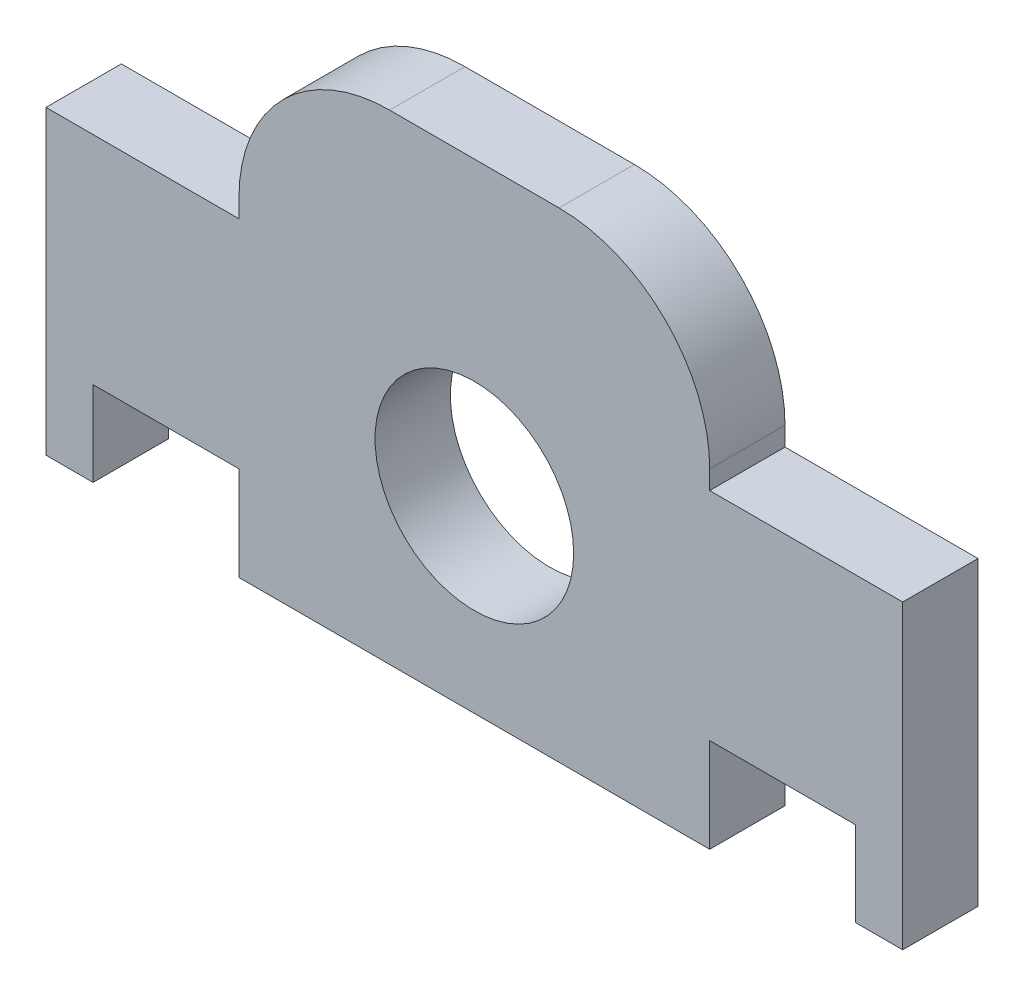
ISO-10303-21;
HEADER;
FILE_DESCRIPTION(('STEP AP214'),'2;1');
FILE_NAME('part.step','',(''),(''),'','','');
FILE_SCHEMA(('AUTOMOTIVE_DESIGN { 1 0 10303 214 1 1 1 1 }'));
ENDSEC;
DATA;
#1=APPLICATION_CONTEXT('core data for automotive mechanical design processes');
#2=APPLICATION_PROTOCOL_DEFINITION('international standard','automotive_design',2000,#1);
#3=PRODUCT_CONTEXT('',#1,'mechanical');
#4=PRODUCT('Part','Part','',(#3));
#5=PRODUCT_RELATED_PRODUCT_CATEGORY('part','',(#4));
#6=PRODUCT_DEFINITION_FORMATION('','',#4);
#7=PRODUCT_DEFINITION_CONTEXT('part definition',#1,'design');
#8=PRODUCT_DEFINITION('design','',#6,#7);
#9=PRODUCT_DEFINITION_SHAPE('','',#8);
#10=(LENGTH_UNIT() NAMED_UNIT(*) SI_UNIT(.MILLI.,.METRE.));
#11=(NAMED_UNIT(*) PLANE_ANGLE_UNIT() SI_UNIT($,.RADIAN.));
#12=(NAMED_UNIT(*) SI_UNIT($,.STERADIAN.) SOLID_ANGLE_UNIT());
#13=UNCERTAINTY_MEASURE_WITH_UNIT(LENGTH_MEASURE(1.E-05),#10,'distance_accuracy_value','');
#14=(GEOMETRIC_REPRESENTATION_CONTEXT(3) GLOBAL_UNCERTAINTY_ASSIGNED_CONTEXT((#13)) GLOBAL_UNIT_ASSIGNED_CONTEXT((#10,
#11,#12)) REPRESENTATION_CONTEXT('',''));
#15=CARTESIAN_POINT('',(0.,0.,0.));
#16=DIRECTION('',(0.,0.,1.));
#17=DIRECTION('',(1.,0.,0.));
#18=AXIS2_PLACEMENT_3D('',#15,#16,#17);
#19=CARTESIAN_POINT('',(0.,-37.205169628433,8.));
#20=DIRECTION('',(0.,1.,0.));
#21=DIRECTION('',(0.,0.,1.));
#22=AXIS2_PLACEMENT_3D('',#19,#20,#21);
#23=PLANE('',#22);
#24=DIRECTION('',(1.,0.,0.));
#25=VECTOR('',#24,1.);
#26=CARTESIAN_POINT('',(0.,-37.205169628433,8.));
#27=LINE('',#26,#25);
#28=CARTESIAN_POINT('',(-23.9256865912763,-37.205169628433,8.));
#29=VERTEX_POINT('',#28);
#30=CARTESIAN_POINT('',(26.0743134087237,-37.205169628433,8.));
#31=VERTEX_POINT('',#30);
#32=EDGE_CURVE('E315',#29,#31,#27,.T.);
#33=ORIENTED_EDGE('',*,*,#32,.F.);
#34=DIRECTION('',(0.,0.,1.));
#35=VECTOR('',#34,1.);
#36=CARTESIAN_POINT('',(-23.9256865912763,-37.205169628433,0.));
#37=LINE('',#36,#35);
#38=CARTESIAN_POINT('',(-23.9256865912763,-37.205169628433,0.));
#39=VERTEX_POINT('',#38);
#40=EDGE_CURVE('E279',#39,#29,#37,.T.);
#41=ORIENTED_EDGE('',*,*,#40,.F.);
#42=DIRECTION('',(1.,0.,0.));
#43=VECTOR('',#42,1.);
#44=CARTESIAN_POINT('',(0.,-37.205169628433,0.));
#45=LINE('',#44,#43);
#46=CARTESIAN_POINT('',(26.0743134087237,-37.205169628433,0.));
#47=VERTEX_POINT('',#46);
#48=EDGE_CURVE('E310',#39,#47,#45,.T.);
#49=ORIENTED_EDGE('',*,*,#48,.T.);
#50=DIRECTION('',(0.,0.,1.));
#51=VECTOR('',#50,1.);
#52=CARTESIAN_POINT('',(26.0743134087237,-37.205169628433,0.));
#53=LINE('',#52,#51);
#54=EDGE_CURVE('E242',#47,#31,#53,.T.);
#55=ORIENTED_EDGE('',*,*,#54,.T.);
#56=EDGE_LOOP('',(#33,#41,#49,#55));
#57=FACE_BOUND('',#56,.T.);
#58=ADVANCED_FACE('F44',(#57),#23,.F.);
#59=CARTESIAN_POINT('',(0.,13.794830371567,8.));
#60=DIRECTION('',(0.,1.,0.));
#61=DIRECTION('',(0.,0.,1.));
#62=AXIS2_PLACEMENT_3D('',#59,#60,#61);
#63=PLANE('',#62);
#64=DIRECTION('',(1.,0.,0.));
#65=VECTOR('',#64,1.);
#66=CARTESIAN_POINT('',(0.,13.794830371567,8.));
#67=LINE('',#66,#65);
#68=CARTESIAN_POINT('',(-7.92568659127614,13.794830371567,8.));
#69=VERTEX_POINT('',#68);
#70=CARTESIAN_POINT('',(10.0743134087236,13.794830371567,8.));
#71=VERTEX_POINT('',#70);
#72=EDGE_CURVE('E52',#69,#71,#67,.T.);
#73=ORIENTED_EDGE('',*,*,#72,.T.);
#74=DIRECTION('',(0.,0.,1.));
#75=VECTOR('',#74,1.);
#76=CARTESIAN_POINT('',(10.0743134087236,13.794830371567,0.));
#77=LINE('',#76,#75);
#78=CARTESIAN_POINT('',(10.0743134087236,13.794830371567,0.));
#79=VERTEX_POINT('',#78);
#80=EDGE_CURVE('E256',#79,#71,#77,.T.);
#81=ORIENTED_EDGE('',*,*,#80,.F.);
#82=DIRECTION('',(1.,0.,0.));
#83=VECTOR('',#82,1.);
#84=CARTESIAN_POINT('',(0.,13.794830371567,0.));
#85=LINE('',#84,#83);
#86=CARTESIAN_POINT('',(-7.92568659127614,13.794830371567,0.));
#87=VERTEX_POINT('',#86);
#88=EDGE_CURVE('E321',#87,#79,#85,.T.);
#89=ORIENTED_EDGE('',*,*,#88,.F.);
#90=DIRECTION('',(0.,0.,1.));
#91=VECTOR('',#90,1.);
#92=CARTESIAN_POINT('',(-7.92568659127614,13.794830371567,0.));
#93=LINE('',#92,#91);
#94=EDGE_CURVE('E299',#87,#69,#93,.T.);
#95=ORIENTED_EDGE('',*,*,#94,.T.);
#96=EDGE_LOOP('',(#73,#81,#89,#95));
#97=FACE_BOUND('',#96,.T.);
#98=ADVANCED_FACE('F345',(#97),#63,.T.);
#99=CARTESIAN_POINT('',(0.,0.,8.));
#100=DIRECTION('',(0.,0.,1.));
#101=DIRECTION('',(1.,0.,0.));
#102=AXIS2_PLACEMENT_3D('',#99,#100,#101);
#103=PLANE('',#102);
#104=CARTESIAN_POINT('',(1.07431340872375,-17.205169628433,8.));
#105=DIRECTION('',(0.,0.,1.));
#106=DIRECTION('',(1.,0.,0.));
#107=AXIS2_PLACEMENT_3D('',#104,#105,#106);
#108=CIRCLE('',#107,10.55);
#109=CARTESIAN_POINT('',(11.6243134087237,-17.205169628433,8.));
#110=VERTEX_POINT('',#109);
#111=EDGE_CURVE('E11',#110,#110,#108,.T.);
#112=ORIENTED_EDGE('',*,*,#111,.F.);
#113=EDGE_LOOP('',(#112));
#114=FACE_BOUND('',#113,.T.);
#115=DIRECTION('',(1.,0.,0.));
#116=VECTOR('',#115,1.);
#117=CARTESIAN_POINT('',(26.0743134087237,-27.205169628433,8.));
#118=LINE('',#117,#116);
#119=CARTESIAN_POINT('',(26.0743134087237,-27.205169628433,8.));
#120=VERTEX_POINT('',#119);
#121=CARTESIAN_POINT('',(41.5743134087237,-27.205169628433,8.));
#122=VERTEX_POINT('',#121);
#123=EDGE_CURVE('E246',#120,#122,#118,.T.);
#124=ORIENTED_EDGE('',*,*,#123,.T.);
#125=DIRECTION('',(0.,1.,0.));
#126=VECTOR('',#125,1.);
#127=CARTESIAN_POINT('',(41.5743134087237,-36.205169628433,8.));
#128=LINE('',#127,#126);
#129=CARTESIAN_POINT('',(41.5743134087237,-36.205169628433,8.));
#130=VERTEX_POINT('',#129);
#131=EDGE_CURVE('E197',#130,#122,#128,.T.);
#132=ORIENTED_EDGE('',*,*,#131,.F.);
#133=DIRECTION('',(1.,0.,0.));
#134=VECTOR('',#133,1.);
#135=CARTESIAN_POINT('',(0.,-36.205169628433,8.));
#136=LINE('',#135,#134);
#137=CARTESIAN_POINT('',(46.5743134087237,-36.205169628433,8.));
#138=VERTEX_POINT('',#137);
#139=EDGE_CURVE('E189',#130,#138,#136,.T.);
#140=ORIENTED_EDGE('',*,*,#139,.T.);
#141=DIRECTION('',(0.,1.,0.));
#142=VECTOR('',#141,1.);
#143=CARTESIAN_POINT('',(46.5743134087237,-36.205169628433,8.));
#144=LINE('',#143,#142);
#145=CARTESIAN_POINT('',(46.5743134087237,-4.20516962843296,8.));
#146=VERTEX_POINT('',#145);
#147=EDGE_CURVE('E172',#138,#146,#144,.T.);
#148=ORIENTED_EDGE('',*,*,#147,.T.);
#149=DIRECTION('',(-1.,0.,0.));
#150=VECTOR('',#149,1.);
#151=CARTESIAN_POINT('',(0.,-4.20516962843296,8.));
#152=LINE('',#151,#150);
#153=CARTESIAN_POINT('',(26.0743134087237,-4.20516962843296,8.));
#154=VERTEX_POINT('',#153);
#155=EDGE_CURVE('E264',#146,#154,#152,.T.);
#156=ORIENTED_EDGE('',*,*,#155,.T.);
#157=DIRECTION('',(0.,-1.,0.));
#158=VECTOR('',#157,1.);
#159=CARTESIAN_POINT('',(26.0743134087237,0.,8.));
#160=LINE('',#159,#158);
#161=CARTESIAN_POINT('',(26.0743134087237,-2.20516962843307,8.));
#162=VERTEX_POINT('',#161);
#163=EDGE_CURVE('E266',#162,#154,#160,.T.);
#164=ORIENTED_EDGE('',*,*,#163,.F.);
#165=CARTESIAN_POINT('',(10.0743134087237,-2.20516962843296,8.));
#166=DIRECTION('',(0.,0.,1.));
#167=DIRECTION('',(1.,0.,0.));
#168=AXIS2_PLACEMENT_3D('',#165,#166,#167);
#169=CIRCLE('',#168,16.);
#170=EDGE_CURVE('E270',#71,#162,#169,.F.);
#171=ORIENTED_EDGE('',*,*,#170,.F.);
#172=ORIENTED_EDGE('',*,*,#72,.F.);
#173=CARTESIAN_POINT('',(-7.92568659127625,-2.20516962843295,8.));
#174=DIRECTION('',(0.,0.,1.));
#175=DIRECTION('',(1.,0.,0.));
#176=AXIS2_PLACEMENT_3D('',#173,#174,#175);
#177=CIRCLE('',#176,16.);
#178=CARTESIAN_POINT('',(-23.9256865912762,-2.20516962843307,8.));
#179=VERTEX_POINT('',#178);
#180=EDGE_CURVE('E273',#69,#179,#177,.T.);
#181=ORIENTED_EDGE('',*,*,#180,.T.);
#182=DIRECTION('',(0.,-1.,0.));
#183=VECTOR('',#182,1.);
#184=CARTESIAN_POINT('',(-23.9256865912762,0.,8.));
#185=LINE('',#184,#183);
#186=CARTESIAN_POINT('',(-23.9256865912762,-4.20516962843296,8.));
#187=VERTEX_POINT('',#186);
#188=EDGE_CURVE('E293',#179,#187,#185,.T.);
#189=ORIENTED_EDGE('',*,*,#188,.T.);
#190=DIRECTION('',(1.,0.,0.));
#191=VECTOR('',#190,1.);
#192=CARTESIAN_POINT('',(0.,-4.20516962843296,8.));
#193=LINE('',#192,#191);
#194=CARTESIAN_POINT('',(-44.4256865912762,-4.20516962843296,8.));
#195=VERTEX_POINT('',#194);
#196=EDGE_CURVE('E302',#195,#187,#193,.T.);
#197=ORIENTED_EDGE('',*,*,#196,.F.);
#198=DIRECTION('',(0.,1.,0.));
#199=VECTOR('',#198,1.);
#200=CARTESIAN_POINT('',(-44.4256865912762,-36.205169628433,8.));
#201=LINE('',#200,#199);
#202=CARTESIAN_POINT('',(-44.4256865912762,-36.205169628433,8.));
#203=VERTEX_POINT('',#202);
#204=EDGE_CURVE('E232',#203,#195,#201,.T.);
#205=ORIENTED_EDGE('',*,*,#204,.F.);
#206=DIRECTION('',(-1.,0.,0.));
#207=VECTOR('',#206,1.);
#208=CARTESIAN_POINT('',(0.,-36.205169628433,8.));
#209=LINE('',#208,#207);
#210=CARTESIAN_POINT('',(-39.4256865912763,-36.205169628433,8.));
#211=VERTEX_POINT('',#210);
#212=EDGE_CURVE('E218',#211,#203,#209,.T.);
#213=ORIENTED_EDGE('',*,*,#212,.F.);
#214=DIRECTION('',(0.,1.,0.));
#215=VECTOR('',#214,1.);
#216=CARTESIAN_POINT('',(-39.4256865912763,-36.205169628433,8.));
#217=LINE('',#216,#215);
#218=CARTESIAN_POINT('',(-39.4256865912763,-27.205169628433,8.));
#219=VERTEX_POINT('',#218);
#220=EDGE_CURVE('E229',#211,#219,#217,.T.);
#221=ORIENTED_EDGE('',*,*,#220,.T.);
#222=DIRECTION('',(1.,0.,0.));
#223=VECTOR('',#222,1.);
#224=CARTESIAN_POINT('',(-33.9256865912763,-27.205169628433,8.));
#225=LINE('',#224,#223);
#226=CARTESIAN_POINT('',(-23.9256865912763,-27.205169628433,8.));
#227=VERTEX_POINT('',#226);
#228=EDGE_CURVE('E263',#219,#227,#225,.T.);
#229=ORIENTED_EDGE('',*,*,#228,.T.);
#230=DIRECTION('',(0.,1.,0.));
#231=VECTOR('',#230,1.);
#232=CARTESIAN_POINT('',(-23.9256865912763,-37.205169628433,8.));
#233=LINE('',#232,#231);
#234=EDGE_CURVE('E282',#29,#227,#233,.T.);
#235=ORIENTED_EDGE('',*,*,#234,.F.);
#236=ORIENTED_EDGE('',*,*,#32,.T.);
#237=DIRECTION('',(0.,1.,0.));
#238=VECTOR('',#237,1.);
#239=CARTESIAN_POINT('',(26.0743134087237,-37.205169628433,8.));
#240=LINE('',#239,#238);
#241=EDGE_CURVE('E248',#31,#120,#240,.T.);
#242=ORIENTED_EDGE('',*,*,#241,.T.);
#243=EDGE_LOOP('',(#124,#132,#140,#148,#156,#164,#171,#172,#181,#189,#197,#205,#213,#221,#229,
#235,#236,#242));
#244=FACE_BOUND('',#243,.T.);
#245=ADVANCED_FACE('F196',(#114,#244),#103,.T.);
#246=CARTESIAN_POINT('',(0.,0.,0.));
#247=DIRECTION('',(0.,0.,1.));
#248=DIRECTION('',(1.,0.,0.));
#249=AXIS2_PLACEMENT_3D('',#246,#247,#248);
#250=PLANE('',#249);
#251=CARTESIAN_POINT('',(1.07431340872375,-17.205169628433,0.));
#252=DIRECTION('',(0.,0.,1.));
#253=DIRECTION('',(1.,0.,0.));
#254=AXIS2_PLACEMENT_3D('',#251,#252,#253);
#255=CIRCLE('',#254,10.55);
#256=CARTESIAN_POINT('',(11.6243134087237,-17.205169628433,0.));
#257=VERTEX_POINT('',#256);
#258=EDGE_CURVE('E47',#257,#257,#255,.T.);
#259=ORIENTED_EDGE('',*,*,#258,.T.);
#260=EDGE_LOOP('',(#259));
#261=FACE_BOUND('',#260,.T.);
#262=DIRECTION('',(-1.,0.,0.));
#263=VECTOR('',#262,1.);
#264=CARTESIAN_POINT('',(0.,-4.20516962843296,0.));
#265=LINE('',#264,#263);
#266=CARTESIAN_POINT('',(46.5743134087237,-4.20516962843296,0.));
#267=VERTEX_POINT('',#266);
#268=CARTESIAN_POINT('',(26.0743134087237,-4.20516962843296,0.));
#269=VERTEX_POINT('',#268);
#270=EDGE_CURVE('E258',#267,#269,#265,.T.);
#271=ORIENTED_EDGE('',*,*,#270,.F.);
#272=DIRECTION('',(0.,1.,0.));
#273=VECTOR('',#272,1.);
#274=CARTESIAN_POINT('',(46.5743134087237,-36.205169628433,0.));
#275=LINE('',#274,#273);
#276=CARTESIAN_POINT('',(46.5743134087237,-36.205169628433,0.));
#277=VERTEX_POINT('',#276);
#278=EDGE_CURVE('E182',#277,#267,#275,.T.);
#279=ORIENTED_EDGE('',*,*,#278,.F.);
#280=DIRECTION('',(1.,0.,0.));
#281=VECTOR('',#280,1.);
#282=CARTESIAN_POINT('',(0.,-36.205169628433,0.));
#283=LINE('',#282,#281);
#284=CARTESIAN_POINT('',(41.5743134087237,-36.205169628433,0.));
#285=VERTEX_POINT('',#284);
#286=EDGE_CURVE('E192',#285,#277,#283,.T.);
#287=ORIENTED_EDGE('',*,*,#286,.F.);
#288=DIRECTION('',(0.,1.,0.));
#289=VECTOR('',#288,1.);
#290=CARTESIAN_POINT('',(41.5743134087237,-36.205169628433,0.));
#291=LINE('',#290,#289);
#292=CARTESIAN_POINT('',(41.5743134087237,-27.205169628433,0.));
#293=VERTEX_POINT('',#292);
#294=EDGE_CURVE('E205',#285,#293,#291,.T.);
#295=ORIENTED_EDGE('',*,*,#294,.T.);
#296=DIRECTION('',(1.,0.,0.));
#297=VECTOR('',#296,1.);
#298=CARTESIAN_POINT('',(26.0743134087237,-27.205169628433,0.));
#299=LINE('',#298,#297);
#300=CARTESIAN_POINT('',(26.0743134087237,-27.205169628433,0.));
#301=VERTEX_POINT('',#300);
#302=EDGE_CURVE('E245',#301,#293,#299,.T.);
#303=ORIENTED_EDGE('',*,*,#302,.F.);
#304=DIRECTION('',(0.,1.,0.));
#305=VECTOR('',#304,1.);
#306=CARTESIAN_POINT('',(26.0743134087237,-37.205169628433,0.));
#307=LINE('',#306,#305);
#308=EDGE_CURVE('E249',#47,#301,#307,.T.);
#309=ORIENTED_EDGE('',*,*,#308,.F.);
#310=ORIENTED_EDGE('',*,*,#48,.F.);
#311=DIRECTION('',(0.,1.,0.));
#312=VECTOR('',#311,1.);
#313=CARTESIAN_POINT('',(-23.9256865912763,-37.205169628433,0.));
#314=LINE('',#313,#312);
#315=CARTESIAN_POINT('',(-23.9256865912763,-27.205169628433,0.));
#316=VERTEX_POINT('',#315);
#317=EDGE_CURVE('E281',#39,#316,#314,.T.);
#318=ORIENTED_EDGE('',*,*,#317,.T.);
#319=DIRECTION('',(1.,0.,0.));
#320=VECTOR('',#319,1.);
#321=CARTESIAN_POINT('',(-33.9256865912763,-27.205169628433,0.));
#322=LINE('',#321,#320);
#323=CARTESIAN_POINT('',(-39.4256865912763,-27.205169628433,0.));
#324=VERTEX_POINT('',#323);
#325=EDGE_CURVE('E284',#324,#316,#322,.T.);
#326=ORIENTED_EDGE('',*,*,#325,.F.);
#327=DIRECTION('',(0.,1.,0.));
#328=VECTOR('',#327,1.);
#329=CARTESIAN_POINT('',(-39.4256865912763,-36.205169628433,0.));
#330=LINE('',#329,#328);
#331=CARTESIAN_POINT('',(-39.4256865912763,-36.205169628433,0.));
#332=VERTEX_POINT('',#331);
#333=EDGE_CURVE('E225',#332,#324,#330,.T.);
#334=ORIENTED_EDGE('',*,*,#333,.F.);
#335=DIRECTION('',(-1.,0.,0.));
#336=VECTOR('',#335,1.);
#337=CARTESIAN_POINT('',(0.,-36.205169628433,0.));
#338=LINE('',#337,#336);
#339=CARTESIAN_POINT('',(-44.4256865912762,-36.205169628433,0.));
#340=VERTEX_POINT('',#339);
#341=EDGE_CURVE('E212',#332,#340,#338,.T.);
#342=ORIENTED_EDGE('',*,*,#341,.T.);
#343=DIRECTION('',(0.,1.,0.));
#344=VECTOR('',#343,1.);
#345=CARTESIAN_POINT('',(-44.4256865912762,-36.205169628433,0.));
#346=LINE('',#345,#344);
#347=CARTESIAN_POINT('',(-44.4256865912762,-4.20516962843296,0.));
#348=VERTEX_POINT('',#347);
#349=EDGE_CURVE('E222',#340,#348,#346,.T.);
#350=ORIENTED_EDGE('',*,*,#349,.T.);
#351=DIRECTION('',(1.,0.,0.));
#352=VECTOR('',#351,1.);
#353=CARTESIAN_POINT('',(0.,-4.20516962843296,0.));
#354=LINE('',#353,#352);
#355=CARTESIAN_POINT('',(-23.9256865912762,-4.20516962843296,0.));
#356=VERTEX_POINT('',#355);
#357=EDGE_CURVE('E292',#348,#356,#354,.T.);
#358=ORIENTED_EDGE('',*,*,#357,.T.);
#359=DIRECTION('',(0.,-1.,0.));
#360=VECTOR('',#359,1.);
#361=CARTESIAN_POINT('',(-23.9256865912762,0.,0.));
#362=LINE('',#361,#360);
#363=CARTESIAN_POINT('',(-23.9256865912762,-2.20516962843307,0.));
#364=VERTEX_POINT('',#363);
#365=EDGE_CURVE('E296',#364,#356,#362,.T.);
#366=ORIENTED_EDGE('',*,*,#365,.F.);
#367=CARTESIAN_POINT('',(-7.92568659127625,-2.20516962843295,0.));
#368=DIRECTION('',(0.,0.,1.));
#369=DIRECTION('',(1.,0.,0.));
#370=AXIS2_PLACEMENT_3D('',#367,#368,#369);
#371=CIRCLE('',#370,16.);
#372=EDGE_CURVE('E290',#87,#364,#371,.T.);
#373=ORIENTED_EDGE('',*,*,#372,.F.);
#374=ORIENTED_EDGE('',*,*,#88,.T.);
#375=CARTESIAN_POINT('',(10.0743134087237,-2.20516962843296,0.));
#376=DIRECTION('',(0.,0.,1.));
#377=DIRECTION('',(1.,0.,0.));
#378=AXIS2_PLACEMENT_3D('',#375,#376,#377);
#379=CIRCLE('',#378,16.);
#380=CARTESIAN_POINT('',(26.0743134087237,-2.20516962843296,0.));
#381=VERTEX_POINT('',#380);
#382=EDGE_CURVE('E267',#79,#381,#379,.F.);
#383=ORIENTED_EDGE('',*,*,#382,.T.);
#384=DIRECTION('',(0.,-1.,0.));
#385=VECTOR('',#384,1.);
#386=CARTESIAN_POINT('',(26.0743134087237,0.,0.));
#387=LINE('',#386,#385);
#388=EDGE_CURVE('E60',#381,#269,#387,.T.);
#389=ORIENTED_EDGE('',*,*,#388,.T.);
#390=EDGE_LOOP('',(#271,#279,#287,#295,#303,#309,#310,#318,#326,#334,#342,#350,#358,#366,#373,
#374,#383,#389));
#391=FACE_BOUND('',#390,.T.);
#392=ADVANCED_FACE('F329',(#261,#391),#250,.F.);
#393=CARTESIAN_POINT('',(1.07431340872375,-17.205169628433,8.));
#394=DIRECTION('',(0.,0.,-1.));
#395=DIRECTION('',(-1.,0.,0.));
#396=AXIS2_PLACEMENT_3D('',#393,#394,#395);
#397=CYLINDRICAL_SURFACE('',#396,10.55);
#398=ORIENTED_EDGE('',*,*,#111,.T.);
#399=EDGE_LOOP('',(#398));
#400=FACE_BOUND('',#399,.T.);
#401=ORIENTED_EDGE('',*,*,#258,.F.);
#402=EDGE_LOOP('',(#401));
#403=FACE_BOUND('',#402,.T.);
#404=ADVANCED_FACE('F331',(#400,#403),#397,.F.);
#405=CARTESIAN_POINT('',(-7.92568659127625,-2.20516962843295,0.));
#406=DIRECTION('',(0.,0.,1.));
#407=DIRECTION('',(1.,0.,0.));
#408=AXIS2_PLACEMENT_3D('',#405,#406,#407);
#409=CYLINDRICAL_SURFACE('',#408,16.);
#410=ORIENTED_EDGE('',*,*,#180,.F.);
#411=ORIENTED_EDGE('',*,*,#94,.F.);
#412=ORIENTED_EDGE('',*,*,#372,.T.);
#413=DIRECTION('',(0.,0.,1.));
#414=VECTOR('',#413,1.);
#415=CARTESIAN_POINT('',(-23.9256865912762,-2.20516962843307,0.));
#416=LINE('',#415,#414);
#417=EDGE_CURVE('E307',#364,#179,#416,.T.);
#418=ORIENTED_EDGE('',*,*,#417,.T.);
#419=EDGE_LOOP('',(#410,#411,#412,#418));
#420=FACE_BOUND('',#419,.T.);
#421=ADVANCED_FACE('F333',(#420),#409,.T.);
#422=CARTESIAN_POINT('',(-23.9256865912762,0.,0.));
#423=DIRECTION('',(-1.,0.,0.));
#424=DIRECTION('',(0.,0.,1.));
#425=AXIS2_PLACEMENT_3D('',#422,#423,#424);
#426=PLANE('',#425);
#427=ORIENTED_EDGE('',*,*,#188,.F.);
#428=ORIENTED_EDGE('',*,*,#417,.F.);
#429=ORIENTED_EDGE('',*,*,#365,.T.);
#430=DIRECTION('',(0.,0.,1.));
#431=VECTOR('',#430,1.);
#432=CARTESIAN_POINT('',(-23.9256865912762,-4.20516962843296,0.));
#433=LINE('',#432,#431);
#434=EDGE_CURVE('E311',#356,#187,#433,.T.);
#435=ORIENTED_EDGE('',*,*,#434,.T.);
#436=EDGE_LOOP('',(#427,#428,#429,#435));
#437=FACE_BOUND('',#436,.T.);
#438=ADVANCED_FACE('F340',(#437),#426,.T.);
#439=CARTESIAN_POINT('',(0.,-4.20516962843296,0.));
#440=DIRECTION('',(0.,-1.,0.));
#441=DIRECTION('',(0.,0.,-1.));
#442=AXIS2_PLACEMENT_3D('',#439,#440,#441);
#443=PLANE('',#442);
#444=ORIENTED_EDGE('',*,*,#196,.T.);
#445=ORIENTED_EDGE('',*,*,#434,.F.);
#446=ORIENTED_EDGE('',*,*,#357,.F.);
#447=DIRECTION('',(0.,0.,1.));
#448=VECTOR('',#447,1.);
#449=CARTESIAN_POINT('',(-44.4256865912762,-4.20516962843296,0.));
#450=LINE('',#449,#448);
#451=EDGE_CURVE('E211',#348,#195,#450,.T.);
#452=ORIENTED_EDGE('',*,*,#451,.T.);
#453=EDGE_LOOP('',(#444,#445,#446,#452));
#454=FACE_BOUND('',#453,.T.);
#455=ADVANCED_FACE('F379',(#454),#443,.F.);
#456=CARTESIAN_POINT('',(26.0743134087237,-37.205169628433,0.));
#457=DIRECTION('',(1.,0.,0.));
#458=DIRECTION('',(0.,0.,-1.));
#459=AXIS2_PLACEMENT_3D('',#456,#457,#458);
#460=PLANE('',#459);
#461=ORIENTED_EDGE('',*,*,#241,.F.);
#462=ORIENTED_EDGE('',*,*,#54,.F.);
#463=ORIENTED_EDGE('',*,*,#308,.T.);
#464=DIRECTION('',(0.,0.,1.));
#465=VECTOR('',#464,1.);
#466=CARTESIAN_POINT('',(26.0743134087237,-27.205169628433,0.));
#467=LINE('',#466,#465);
#468=EDGE_CURVE('E239',#301,#120,#467,.T.);
#469=ORIENTED_EDGE('',*,*,#468,.T.);
#470=EDGE_LOOP('',(#461,#462,#463,#469));
#471=FACE_BOUND('',#470,.T.);
#472=ADVANCED_FACE('F360',(#471),#460,.T.);
#473=CARTESIAN_POINT('',(26.0743134087237,-27.205169628433,0.));
#474=DIRECTION('',(0.,-1.,0.));
#475=DIRECTION('',(0.,0.,-1.));
#476=AXIS2_PLACEMENT_3D('',#473,#474,#475);
#477=PLANE('',#476);
#478=ORIENTED_EDGE('',*,*,#123,.F.);
#479=ORIENTED_EDGE('',*,*,#468,.F.);
#480=ORIENTED_EDGE('',*,*,#302,.T.);
#481=DIRECTION('',(0.,0.,1.));
#482=VECTOR('',#481,1.);
#483=CARTESIAN_POINT('',(41.5743134087237,-27.205169628433,0.));
#484=LINE('',#483,#482);
#485=EDGE_CURVE('E204',#293,#122,#484,.T.);
#486=ORIENTED_EDGE('',*,*,#485,.T.);
#487=EDGE_LOOP('',(#478,#479,#480,#486));
#488=FACE_BOUND('',#487,.T.);
#489=ADVANCED_FACE('F362',(#488),#477,.T.);
#490=CARTESIAN_POINT('',(-33.9256865912763,-27.205169628433,0.));
#491=DIRECTION('',(0.,-1.,0.));
#492=DIRECTION('',(0.,0.,-1.));
#493=AXIS2_PLACEMENT_3D('',#490,#491,#492);
#494=PLANE('',#493);
#495=ORIENTED_EDGE('',*,*,#228,.F.);
#496=DIRECTION('',(0.,0.,1.));
#497=VECTOR('',#496,1.);
#498=CARTESIAN_POINT('',(-39.4256865912763,-27.205169628433,0.));
#499=LINE('',#498,#497);
#500=EDGE_CURVE('E228',#324,#219,#499,.T.);
#501=ORIENTED_EDGE('',*,*,#500,.F.);
#502=ORIENTED_EDGE('',*,*,#325,.T.);
#503=DIRECTION('',(0.,0.,1.));
#504=VECTOR('',#503,1.);
#505=CARTESIAN_POINT('',(-23.9256865912763,-27.205169628433,0.));
#506=LINE('',#505,#504);
#507=EDGE_CURVE('E68',#316,#227,#506,.T.);
#508=ORIENTED_EDGE('',*,*,#507,.T.);
#509=EDGE_LOOP('',(#495,#501,#502,#508));
#510=FACE_BOUND('',#509,.T.);
#511=ADVANCED_FACE('F393',(#510),#494,.T.);
#512=CARTESIAN_POINT('',(-23.9256865912763,-37.205169628433,0.));
#513=DIRECTION('',(1.,0.,0.));
#514=DIRECTION('',(0.,0.,-1.));
#515=AXIS2_PLACEMENT_3D('',#512,#513,#514);
#516=PLANE('',#515);
#517=ORIENTED_EDGE('',*,*,#234,.T.);
#518=ORIENTED_EDGE('',*,*,#507,.F.);
#519=ORIENTED_EDGE('',*,*,#317,.F.);
#520=ORIENTED_EDGE('',*,*,#40,.T.);
#521=EDGE_LOOP('',(#517,#518,#519,#520));
#522=FACE_BOUND('',#521,.T.);
#523=ADVANCED_FACE('F355',(#522),#516,.F.);
#524=CARTESIAN_POINT('',(0.,-4.20516962843296,0.));
#525=DIRECTION('',(0.,1.,0.));
#526=DIRECTION('',(-1.,0.,0.));
#527=AXIS2_PLACEMENT_3D('',#524,#525,#526);
#528=PLANE('',#527);
#529=ORIENTED_EDGE('',*,*,#155,.F.);
#530=DIRECTION('',(0.,0.,-1.));
#531=VECTOR('',#530,1.);
#532=CARTESIAN_POINT('',(46.5743134087237,-4.20516962843296,0.));
#533=LINE('',#532,#531);
#534=EDGE_CURVE('E178',#146,#267,#533,.T.);
#535=ORIENTED_EDGE('',*,*,#534,.T.);
#536=ORIENTED_EDGE('',*,*,#270,.T.);
#537=DIRECTION('',(0.,0.,1.));
#538=VECTOR('',#537,1.);
#539=CARTESIAN_POINT('',(26.0743134087237,-4.20516962843296,0.));
#540=LINE('',#539,#538);
#541=EDGE_CURVE('E261',#269,#154,#540,.T.);
#542=ORIENTED_EDGE('',*,*,#541,.T.);
#543=EDGE_LOOP('',(#529,#535,#536,#542));
#544=FACE_BOUND('',#543,.T.);
#545=ADVANCED_FACE('F366',(#544),#528,.T.);
#546=CARTESIAN_POINT('',(26.0743134087237,0.,0.));
#547=DIRECTION('',(-1.,0.,0.));
#548=DIRECTION('',(0.,0.,1.));
#549=AXIS2_PLACEMENT_3D('',#546,#547,#548);
#550=PLANE('',#549);
#551=ORIENTED_EDGE('',*,*,#163,.T.);
#552=ORIENTED_EDGE('',*,*,#541,.F.);
#553=ORIENTED_EDGE('',*,*,#388,.F.);
#554=DIRECTION('',(0.,0.,1.));
#555=VECTOR('',#554,1.);
#556=CARTESIAN_POINT('',(26.0743134087237,-2.20516962843307,0.));
#557=LINE('',#556,#555);
#558=EDGE_CURVE('E259',#381,#162,#557,.T.);
#559=ORIENTED_EDGE('',*,*,#558,.T.);
#560=EDGE_LOOP('',(#551,#552,#553,#559));
#561=FACE_BOUND('',#560,.T.);
#562=ADVANCED_FACE('F370',(#561),#550,.F.);
#563=CARTESIAN_POINT('',(10.0743134087237,-2.20516962843296,0.));
#564=DIRECTION('',(0.,0.,1.));
#565=DIRECTION('',(1.,0.,0.));
#566=AXIS2_PLACEMENT_3D('',#563,#564,#565);
#567=CYLINDRICAL_SURFACE('',#566,16.);
#568=ORIENTED_EDGE('',*,*,#170,.T.);
#569=ORIENTED_EDGE('',*,*,#558,.F.);
#570=ORIENTED_EDGE('',*,*,#382,.F.);
#571=ORIENTED_EDGE('',*,*,#80,.T.);
#572=EDGE_LOOP('',(#568,#569,#570,#571));
#573=FACE_BOUND('',#572,.T.);
#574=ADVANCED_FACE('F372',(#573),#567,.T.);
#575=CARTESIAN_POINT('',(-39.4256865912763,-36.205169628433,0.));
#576=DIRECTION('',(-1.,0.,0.));
#577=DIRECTION('',(0.,0.,1.));
#578=AXIS2_PLACEMENT_3D('',#575,#576,#577);
#579=PLANE('',#578);
#580=ORIENTED_EDGE('',*,*,#333,.T.);
#581=ORIENTED_EDGE('',*,*,#500,.T.);
#582=ORIENTED_EDGE('',*,*,#220,.F.);
#583=DIRECTION('',(0.,0.,1.));
#584=VECTOR('',#583,1.);
#585=CARTESIAN_POINT('',(-39.4256865912763,-36.205169628433,0.));
#586=LINE('',#585,#584);
#587=EDGE_CURVE('E220',#332,#211,#586,.T.);
#588=ORIENTED_EDGE('',*,*,#587,.F.);
#589=EDGE_LOOP('',(#580,#581,#582,#588));
#590=FACE_BOUND('',#589,.T.);
#591=ADVANCED_FACE('F391',(#590),#579,.F.);
#592=CARTESIAN_POINT('',(-44.4256865912762,-36.205169628433,0.));
#593=DIRECTION('',(-1.,0.,0.));
#594=DIRECTION('',(0.,0.,1.));
#595=AXIS2_PLACEMENT_3D('',#592,#593,#594);
#596=PLANE('',#595);
#597=ORIENTED_EDGE('',*,*,#451,.F.);
#598=ORIENTED_EDGE('',*,*,#349,.F.);
#599=DIRECTION('',(0.,0.,1.));
#600=VECTOR('',#599,1.);
#601=CARTESIAN_POINT('',(-44.4256865912762,-36.205169628433,0.));
#602=LINE('',#601,#600);
#603=EDGE_CURVE('E215',#340,#203,#602,.T.);
#604=ORIENTED_EDGE('',*,*,#603,.T.);
#605=ORIENTED_EDGE('',*,*,#204,.T.);
#606=EDGE_LOOP('',(#597,#598,#604,#605));
#607=FACE_BOUND('',#606,.T.);
#608=ADVANCED_FACE('F383',(#607),#596,.T.);
#609=CARTESIAN_POINT('',(0.,-36.205169628433,0.));
#610=DIRECTION('',(0.,1.,0.));
#611=DIRECTION('',(0.,0.,1.));
#612=AXIS2_PLACEMENT_3D('',#609,#610,#611);
#613=PLANE('',#612);
#614=ORIENTED_EDGE('',*,*,#341,.F.);
#615=ORIENTED_EDGE('',*,*,#587,.T.);
#616=ORIENTED_EDGE('',*,*,#212,.T.);
#617=ORIENTED_EDGE('',*,*,#603,.F.);
#618=EDGE_LOOP('',(#614,#615,#616,#617));
#619=FACE_BOUND('',#618,.T.);
#620=ADVANCED_FACE('F387',(#619),#613,.F.);
#621=CARTESIAN_POINT('',(41.5743134087237,-36.205169628433,0.));
#622=DIRECTION('',(-1.,0.,0.));
#623=DIRECTION('',(0.,0.,1.));
#624=AXIS2_PLACEMENT_3D('',#621,#622,#623);
#625=PLANE('',#624);
#626=ORIENTED_EDGE('',*,*,#485,.F.);
#627=ORIENTED_EDGE('',*,*,#294,.F.);
#628=DIRECTION('',(0.,0.,1.));
#629=VECTOR('',#628,1.);
#630=CARTESIAN_POINT('',(41.5743134087237,-36.205169628433,0.));
#631=LINE('',#630,#629);
#632=EDGE_CURVE('E183',#285,#130,#631,.T.);
#633=ORIENTED_EDGE('',*,*,#632,.T.);
#634=ORIENTED_EDGE('',*,*,#131,.T.);
#635=EDGE_LOOP('',(#626,#627,#633,#634));
#636=FACE_BOUND('',#635,.T.);
#637=ADVANCED_FACE('F364',(#636),#625,.T.);
#638=CARTESIAN_POINT('',(46.5743134087237,-36.205169628433,0.));
#639=DIRECTION('',(1.,0.,0.));
#640=DIRECTION('',(0.,0.,-1.));
#641=AXIS2_PLACEMENT_3D('',#638,#639,#640);
#642=PLANE('',#641);
#643=ORIENTED_EDGE('',*,*,#534,.F.);
#644=ORIENTED_EDGE('',*,*,#147,.F.);
#645=DIRECTION('',(0.,0.,-1.));
#646=VECTOR('',#645,1.);
#647=CARTESIAN_POINT('',(46.5743134087237,-36.205169628433,0.));
#648=LINE('',#647,#646);
#649=EDGE_CURVE('E176',#138,#277,#648,.T.);
#650=ORIENTED_EDGE('',*,*,#649,.T.);
#651=ORIENTED_EDGE('',*,*,#278,.T.);
#652=EDGE_LOOP('',(#643,#644,#650,#651));
#653=FACE_BOUND('',#652,.T.);
#654=ADVANCED_FACE('F174',(#653),#642,.T.);
#655=CARTESIAN_POINT('',(0.,-36.205169628433,0.));
#656=DIRECTION('',(0.,1.,0.));
#657=DIRECTION('',(0.,0.,1.));
#658=AXIS2_PLACEMENT_3D('',#655,#656,#657);
#659=PLANE('',#658);
#660=ORIENTED_EDGE('',*,*,#139,.F.);
#661=ORIENTED_EDGE('',*,*,#632,.F.);
#662=ORIENTED_EDGE('',*,*,#286,.T.);
#663=ORIENTED_EDGE('',*,*,#649,.F.);
#664=EDGE_LOOP('',(#660,#661,#662,#663));
#665=FACE_BOUND('',#664,.T.);
#666=ADVANCED_FACE('F187',(#665),#659,.F.);
#667=CLOSED_SHELL('',(#58,#98,#245,#392,#404,#421,#438,#455,#472,#489,#511,#523,#545,#562,#574,
#591,#608,#620,#637,#654,#666));
#668=MANIFOLD_SOLID_BREP('B2',#667);
#669=ADVANCED_BREP_SHAPE_REPRESENTATION('',(#18,#668),#14);
#670=SHAPE_DEFINITION_REPRESENTATION(#9,#669);
ENDSEC;
END-ISO-10303-21;
